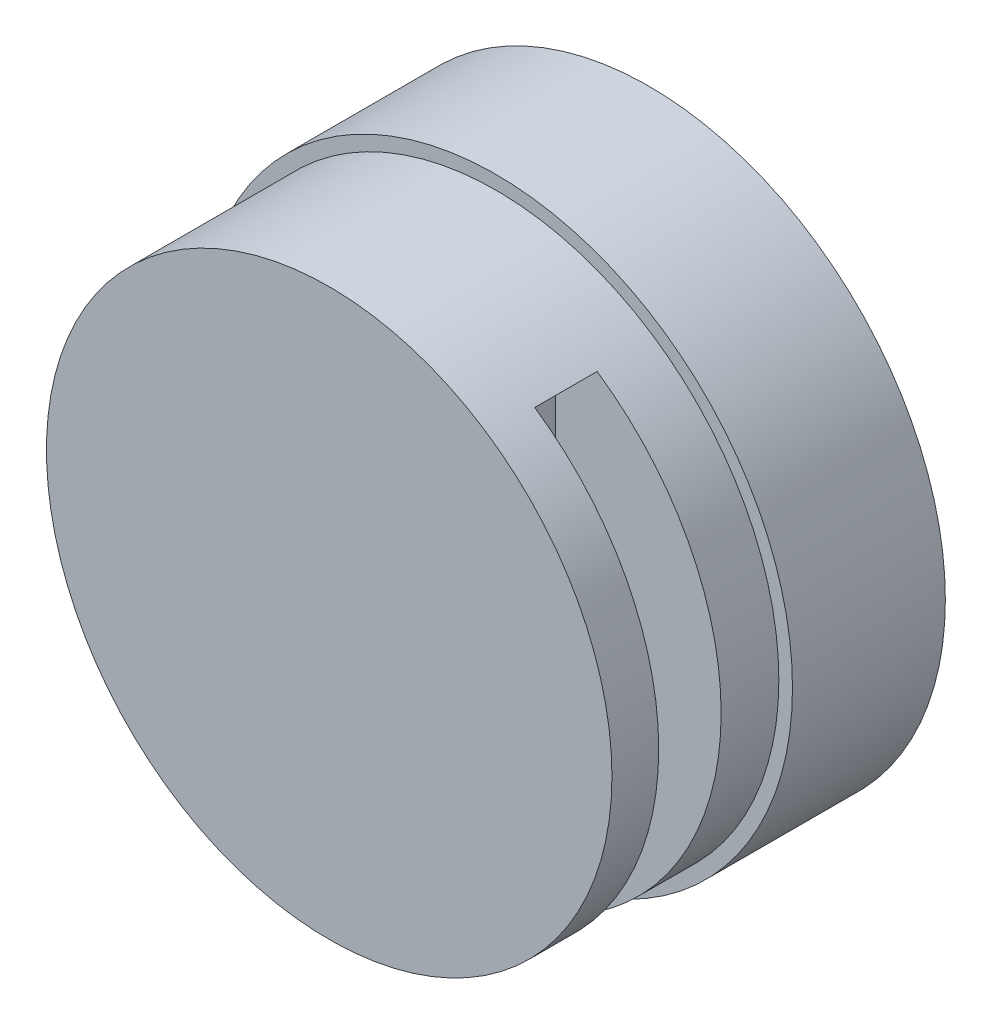
ISO-10303-21;
HEADER;
FILE_DESCRIPTION(('STEP AP214'),'2;1');
FILE_NAME('part.step','',(''),(''),'','','');
FILE_SCHEMA(('AUTOMOTIVE_DESIGN { 1 0 10303 214 1 1 1 1 }'));
ENDSEC;
DATA;
#1=APPLICATION_CONTEXT('core data for automotive mechanical design processes');
#2=APPLICATION_PROTOCOL_DEFINITION('international standard','automotive_design',2000,#1);
#3=PRODUCT_CONTEXT('',#1,'mechanical');
#4=PRODUCT('Part','Part','',(#3));
#5=PRODUCT_RELATED_PRODUCT_CATEGORY('part','',(#4));
#6=PRODUCT_DEFINITION_FORMATION('','',#4);
#7=PRODUCT_DEFINITION_CONTEXT('part definition',#1,'design');
#8=PRODUCT_DEFINITION('design','',#6,#7);
#9=PRODUCT_DEFINITION_SHAPE('','',#8);
#10=(LENGTH_UNIT() NAMED_UNIT(*) SI_UNIT(.MILLI.,.METRE.));
#11=(NAMED_UNIT(*) PLANE_ANGLE_UNIT() SI_UNIT($,.RADIAN.));
#12=(NAMED_UNIT(*) SI_UNIT($,.STERADIAN.) SOLID_ANGLE_UNIT());
#13=UNCERTAINTY_MEASURE_WITH_UNIT(LENGTH_MEASURE(1.E-05),#10,'distance_accuracy_value','');
#14=(GEOMETRIC_REPRESENTATION_CONTEXT(3) GLOBAL_UNCERTAINTY_ASSIGNED_CONTEXT((#13)) GLOBAL_UNIT_ASSIGNED_CONTEXT((#10,
#11,#12)) REPRESENTATION_CONTEXT('',''));
#15=CARTESIAN_POINT('',(0.,0.,0.));
#16=DIRECTION('',(0.,0.,1.));
#17=DIRECTION('',(1.,0.,0.));
#18=AXIS2_PLACEMENT_3D('',#15,#16,#17);
#19=CARTESIAN_POINT('',(0.,0.,41.));
#20=DIRECTION('',(0.,0.,-1.));
#21=DIRECTION('',(-1.,0.,0.));
#22=AXIS2_PLACEMENT_3D('',#19,#20,#21);
#23=CYLINDRICAL_SURFACE('',#22,36.25);
#24=CARTESIAN_POINT('',(0.,0.,19.6));
#25=DIRECTION('',(0.,0.,1.));
#26=DIRECTION('',(1.,0.,0.));
#27=AXIS2_PLACEMENT_3D('',#24,#25,#26);
#28=CIRCLE('',#27,36.25);
#29=CARTESIAN_POINT('',(36.25,0.,19.6));
#30=VERTEX_POINT('',#29);
#31=EDGE_CURVE('E11',#30,#30,#28,.T.);
#32=ORIENTED_EDGE('',*,*,#31,.T.);
#33=EDGE_LOOP('',(#32));
#34=FACE_BOUND('',#33,.T.);
#35=CARTESIAN_POINT('',(0.,0.,41.));
#36=DIRECTION('',(0.,0.,1.));
#37=DIRECTION('',(1.,0.,0.));
#38=AXIS2_PLACEMENT_3D('',#35,#36,#37);
#39=CIRCLE('',#38,36.25);
#40=CARTESIAN_POINT('',(36.25,0.,41.));
#41=VERTEX_POINT('',#40);
#42=EDGE_CURVE('E133',#41,#41,#39,.T.);
#43=ORIENTED_EDGE('',*,*,#42,.F.);
#44=EDGE_LOOP('',(#43));
#45=FACE_BOUND('',#44,.T.);
#46=DIRECTION('',(0.,0.,-1.));
#47=VECTOR('',#46,1.);
#48=CARTESIAN_POINT('',(20.3485257451246,30.,41.));
#49=LINE('',#48,#47);
#50=CARTESIAN_POINT('',(20.3485257451246,30.,35.));
#51=VERTEX_POINT('',#50);
#52=CARTESIAN_POINT('',(20.3485257451246,30.,27.));
#53=VERTEX_POINT('',#52);
#54=EDGE_CURVE('E94',#51,#53,#49,.T.);
#55=ORIENTED_EDGE('',*,*,#54,.T.);
#56=CARTESIAN_POINT('',(0.,0.,27.));
#57=DIRECTION('',(0.,0.,1.));
#58=DIRECTION('',(0.,-1.,0.));
#59=AXIS2_PLACEMENT_3D('',#56,#57,#58);
#60=CIRCLE('',#59,36.25);
#61=CARTESIAN_POINT('',(20.3485257451246,-30.,27.));
#62=VERTEX_POINT('',#61);
#63=EDGE_CURVE('E82',#53,#62,#60,.F.);
#64=ORIENTED_EDGE('',*,*,#63,.T.);
#65=DIRECTION('',(0.,0.,-1.));
#66=VECTOR('',#65,1.);
#67=CARTESIAN_POINT('',(20.3485257451246,-30.,41.));
#68=LINE('',#67,#66);
#69=CARTESIAN_POINT('',(20.3485257451246,-30.,35.));
#70=VERTEX_POINT('',#69);
#71=EDGE_CURVE('E77',#62,#70,#68,.F.);
#72=ORIENTED_EDGE('',*,*,#71,.T.);
#73=CARTESIAN_POINT('',(0.,0.,35.));
#74=DIRECTION('',(0.,0.,-1.));
#75=DIRECTION('',(0.,1.,0.));
#76=AXIS2_PLACEMENT_3D('',#73,#74,#75);
#77=CIRCLE('',#76,36.25);
#78=EDGE_CURVE('E97',#70,#51,#77,.F.);
#79=ORIENTED_EDGE('',*,*,#78,.T.);
#80=EDGE_LOOP('',(#55,#64,#72,#79));
#81=FACE_BOUND('',#80,.T.);
#82=ADVANCED_FACE('F36',(#34,#45,#81),#23,.T.);
#83=CARTESIAN_POINT('',(0.,0.,19.6));
#84=DIRECTION('',(0.,0.,-1.));
#85=DIRECTION('',(-1.,0.,0.));
#86=AXIS2_PLACEMENT_3D('',#83,#84,#85);
#87=CYLINDRICAL_SURFACE('',#86,38.);
#88=CARTESIAN_POINT('',(0.,0.,19.6));
#89=DIRECTION('',(0.,0.,1.));
#90=DIRECTION('',(1.,0.,0.));
#91=AXIS2_PLACEMENT_3D('',#88,#89,#90);
#92=CIRCLE('',#91,38.);
#93=CARTESIAN_POINT('',(38.,0.,19.6));
#94=VERTEX_POINT('',#93);
#95=EDGE_CURVE('E45',#94,#94,#92,.T.);
#96=ORIENTED_EDGE('',*,*,#95,.F.);
#97=EDGE_LOOP('',(#96));
#98=FACE_BOUND('',#97,.T.);
#99=CARTESIAN_POINT('',(0.,0.,0.));
#100=DIRECTION('',(0.,0.,1.));
#101=DIRECTION('',(1.,0.,0.));
#102=AXIS2_PLACEMENT_3D('',#99,#100,#101);
#103=CIRCLE('',#102,38.);
#104=CARTESIAN_POINT('',(38.,0.,0.));
#105=VERTEX_POINT('',#104);
#106=EDGE_CURVE('E40',#105,#105,#103,.T.);
#107=ORIENTED_EDGE('',*,*,#106,.T.);
#108=EDGE_LOOP('',(#107));
#109=FACE_BOUND('',#108,.T.);
#110=ADVANCED_FACE('F38',(#98,#109),#87,.T.);
#111=CARTESIAN_POINT('',(0.,0.,19.6));
#112=DIRECTION('',(0.,0.,1.));
#113=DIRECTION('',(1.,0.,0.));
#114=AXIS2_PLACEMENT_3D('',#111,#112,#113);
#115=PLANE('',#114);
#116=ORIENTED_EDGE('',*,*,#31,.F.);
#117=EDGE_LOOP('',(#116));
#118=FACE_BOUND('',#117,.T.);
#119=ORIENTED_EDGE('',*,*,#95,.T.);
#120=EDGE_LOOP('',(#119));
#121=FACE_BOUND('',#120,.T.);
#122=ADVANCED_FACE('F147',(#118,#121),#115,.T.);
#123=CARTESIAN_POINT('',(0.,0.,0.));
#124=DIRECTION('',(0.,0.,1.));
#125=DIRECTION('',(1.,0.,0.));
#126=AXIS2_PLACEMENT_3D('',#123,#124,#125);
#127=PLANE('',#126);
#128=CARTESIAN_POINT('',(20.8596500450032,20.8596500450031,0.));
#129=DIRECTION('',(0.,0.,-1.));
#130=DIRECTION('',(-1.,0.,0.));
#131=AXIS2_PLACEMENT_3D('',#128,#129,#130);
#132=CIRCLE('',#131,1.5);
#133=CARTESIAN_POINT('',(19.3596500450031,20.8596500450031,0.));
#134=VERTEX_POINT('',#133);
#135=EDGE_CURVE('E127',#134,#134,#132,.T.);
#136=ORIENTED_EDGE('',*,*,#135,.F.);
#137=EDGE_LOOP('',(#136));
#138=FACE_BOUND('',#137,.T.);
#139=CARTESIAN_POINT('',(20.8596500450031,-20.8596500450032,0.));
#140=DIRECTION('',(0.,0.,-1.));
#141=DIRECTION('',(-1.,0.,0.));
#142=AXIS2_PLACEMENT_3D('',#139,#140,#141);
#143=CIRCLE('',#142,1.5);
#144=CARTESIAN_POINT('',(19.3596500450031,-20.8596500450032,0.));
#145=VERTEX_POINT('',#144);
#146=EDGE_CURVE('E121',#145,#145,#143,.T.);
#147=ORIENTED_EDGE('',*,*,#146,.F.);
#148=EDGE_LOOP('',(#147));
#149=FACE_BOUND('',#148,.T.);
#150=CARTESIAN_POINT('',(-20.8596500450031,-20.8596500450031,0.));
#151=DIRECTION('',(0.,0.,-1.));
#152=DIRECTION('',(-1.,0.,0.));
#153=AXIS2_PLACEMENT_3D('',#150,#151,#152);
#154=CIRCLE('',#153,1.5);
#155=CARTESIAN_POINT('',(-22.3596500450032,-20.8596500450031,0.));
#156=VERTEX_POINT('',#155);
#157=EDGE_CURVE('E115',#156,#156,#154,.T.);
#158=ORIENTED_EDGE('',*,*,#157,.F.);
#159=EDGE_LOOP('',(#158));
#160=FACE_BOUND('',#159,.T.);
#161=CARTESIAN_POINT('',(-20.8596500450031,20.8596500450031,0.));
#162=DIRECTION('',(0.,0.,-1.));
#163=DIRECTION('',(-1.,0.,0.));
#164=AXIS2_PLACEMENT_3D('',#161,#162,#163);
#165=CIRCLE('',#164,1.5);
#166=CARTESIAN_POINT('',(-22.3596500450032,20.8596500450031,0.));
#167=VERTEX_POINT('',#166);
#168=EDGE_CURVE('E114',#167,#167,#165,.T.);
#169=ORIENTED_EDGE('',*,*,#168,.F.);
#170=EDGE_LOOP('',(#169));
#171=FACE_BOUND('',#170,.T.);
#172=ORIENTED_EDGE('',*,*,#106,.F.);
#173=EDGE_LOOP('',(#172));
#174=FACE_BOUND('',#173,.T.);
#175=ADVANCED_FACE('F144',(#138,#149,#160,#171,#174),#127,.F.);
#176=CARTESIAN_POINT('',(0.,0.,41.));
#177=DIRECTION('',(0.,0.,1.));
#178=DIRECTION('',(1.,0.,0.));
#179=AXIS2_PLACEMENT_3D('',#176,#177,#178);
#180=PLANE('',#179);
#181=ORIENTED_EDGE('',*,*,#42,.T.);
#182=EDGE_LOOP('',(#181));
#183=FACE_BOUND('',#182,.T.);
#184=ADVANCED_FACE('F146',(#183),#180,.T.);
#185=CARTESIAN_POINT('',(-20.8596500450031,20.8596500450031,4.));
#186=DIRECTION('',(0.,0.,-1.));
#187=DIRECTION('',(-1.,0.,0.));
#188=AXIS2_PLACEMENT_3D('',#185,#186,#187);
#189=CYLINDRICAL_SURFACE('',#188,1.5);
#190=CARTESIAN_POINT('',(-20.8596500450031,20.8596500450031,4.));
#191=DIRECTION('',(0.,0.,-1.));
#192=DIRECTION('',(-1.,0.,0.));
#193=AXIS2_PLACEMENT_3D('',#190,#191,#192);
#194=CIRCLE('',#193,1.5);
#195=CARTESIAN_POINT('',(-22.3596500450032,20.8596500450031,4.));
#196=VERTEX_POINT('',#195);
#197=EDGE_CURVE('E130',#196,#196,#194,.T.);
#198=ORIENTED_EDGE('',*,*,#197,.F.);
#199=EDGE_LOOP('',(#198));
#200=FACE_BOUND('',#199,.T.);
#201=ORIENTED_EDGE('',*,*,#168,.T.);
#202=EDGE_LOOP('',(#201));
#203=FACE_BOUND('',#202,.T.);
#204=ADVANCED_FACE('F153',(#200,#203),#189,.F.);
#205=CARTESIAN_POINT('',(-20.8596500450031,20.8596500450031,4.));
#206=DIRECTION('',(0.,0.,-1.));
#207=DIRECTION('',(-1.,0.,0.));
#208=AXIS2_PLACEMENT_3D('',#205,#206,#207);
#209=PLANE('',#208);
#210=ORIENTED_EDGE('',*,*,#197,.T.);
#211=EDGE_LOOP('',(#210));
#212=FACE_BOUND('',#211,.T.);
#213=ADVANCED_FACE('F171',(#212),#209,.T.);
#214=CARTESIAN_POINT('',(-20.8596500450031,-20.8596500450031,4.));
#215=DIRECTION('',(0.,0.,-1.));
#216=DIRECTION('',(-1.,0.,0.));
#217=AXIS2_PLACEMENT_3D('',#214,#215,#216);
#218=CYLINDRICAL_SURFACE('',#217,1.5);
#219=CARTESIAN_POINT('',(-20.8596500450031,-20.8596500450031,4.));
#220=DIRECTION('',(0.,0.,-1.));
#221=DIRECTION('',(-1.,0.,0.));
#222=AXIS2_PLACEMENT_3D('',#219,#220,#221);
#223=CIRCLE('',#222,1.5);
#224=CARTESIAN_POINT('',(-22.3596500450032,-20.8596500450031,4.));
#225=VERTEX_POINT('',#224);
#226=EDGE_CURVE('E111',#225,#225,#223,.T.);
#227=ORIENTED_EDGE('',*,*,#226,.F.);
#228=EDGE_LOOP('',(#227));
#229=FACE_BOUND('',#228,.T.);
#230=ORIENTED_EDGE('',*,*,#157,.T.);
#231=EDGE_LOOP('',(#230));
#232=FACE_BOUND('',#231,.T.);
#233=ADVANCED_FACE('F175',(#229,#232),#218,.F.);
#234=CARTESIAN_POINT('',(-20.8596500450031,-20.8596500450031,4.));
#235=DIRECTION('',(0.,0.,-1.));
#236=DIRECTION('',(-1.,0.,0.));
#237=AXIS2_PLACEMENT_3D('',#234,#235,#236);
#238=PLANE('',#237);
#239=ORIENTED_EDGE('',*,*,#226,.T.);
#240=EDGE_LOOP('',(#239));
#241=FACE_BOUND('',#240,.T.);
#242=ADVANCED_FACE('F190',(#241),#238,.T.);
#243=CARTESIAN_POINT('',(20.8596500450031,-20.8596500450032,4.));
#244=DIRECTION('',(0.,0.,-1.));
#245=DIRECTION('',(-1.,0.,0.));
#246=AXIS2_PLACEMENT_3D('',#243,#244,#245);
#247=CYLINDRICAL_SURFACE('',#246,1.5);
#248=CARTESIAN_POINT('',(20.8596500450031,-20.8596500450032,4.));
#249=DIRECTION('',(0.,0.,-1.));
#250=DIRECTION('',(-1.,0.,0.));
#251=AXIS2_PLACEMENT_3D('',#248,#249,#250);
#252=CIRCLE('',#251,1.5);
#253=CARTESIAN_POINT('',(19.3596500450031,-20.8596500450032,4.));
#254=VERTEX_POINT('',#253);
#255=EDGE_CURVE('E118',#254,#254,#252,.T.);
#256=ORIENTED_EDGE('',*,*,#255,.F.);
#257=EDGE_LOOP('',(#256));
#258=FACE_BOUND('',#257,.T.);
#259=ORIENTED_EDGE('',*,*,#146,.T.);
#260=EDGE_LOOP('',(#259));
#261=FACE_BOUND('',#260,.T.);
#262=ADVANCED_FACE('F187',(#258,#261),#247,.F.);
#263=CARTESIAN_POINT('',(20.8596500450031,-20.8596500450032,4.));
#264=DIRECTION('',(0.,0.,-1.));
#265=DIRECTION('',(-1.,0.,0.));
#266=AXIS2_PLACEMENT_3D('',#263,#264,#265);
#267=PLANE('',#266);
#268=ORIENTED_EDGE('',*,*,#255,.T.);
#269=EDGE_LOOP('',(#268));
#270=FACE_BOUND('',#269,.T.);
#271=ADVANCED_FACE('F181',(#270),#267,.T.);
#272=CARTESIAN_POINT('',(20.8596500450032,20.8596500450031,4.));
#273=DIRECTION('',(0.,0.,-1.));
#274=DIRECTION('',(-1.,0.,0.));
#275=AXIS2_PLACEMENT_3D('',#272,#273,#274);
#276=CYLINDRICAL_SURFACE('',#275,1.5);
#277=CARTESIAN_POINT('',(20.8596500450032,20.8596500450031,4.));
#278=DIRECTION('',(0.,0.,-1.));
#279=DIRECTION('',(-1.,0.,0.));
#280=AXIS2_PLACEMENT_3D('',#277,#278,#279);
#281=CIRCLE('',#280,1.5);
#282=CARTESIAN_POINT('',(19.3596500450031,20.8596500450031,4.));
#283=VERTEX_POINT('',#282);
#284=EDGE_CURVE('E124',#283,#283,#281,.T.);
#285=ORIENTED_EDGE('',*,*,#284,.F.);
#286=EDGE_LOOP('',(#285));
#287=FACE_BOUND('',#286,.T.);
#288=ORIENTED_EDGE('',*,*,#135,.T.);
#289=EDGE_LOOP('',(#288));
#290=FACE_BOUND('',#289,.T.);
#291=ADVANCED_FACE('F177',(#287,#290),#276,.F.);
#292=CARTESIAN_POINT('',(20.8596500450032,20.8596500450031,4.));
#293=DIRECTION('',(0.,0.,-1.));
#294=DIRECTION('',(-1.,0.,0.));
#295=AXIS2_PLACEMENT_3D('',#292,#293,#294);
#296=PLANE('',#295);
#297=ORIENTED_EDGE('',*,*,#284,.T.);
#298=EDGE_LOOP('',(#297));
#299=FACE_BOUND('',#298,.T.);
#300=ADVANCED_FACE('F180',(#299),#296,.T.);
#301=CARTESIAN_POINT('',(15.,0.,0.));
#302=DIRECTION('',(1.,0.,0.));
#303=DIRECTION('',(0.,0.,-1.));
#304=AXIS2_PLACEMENT_3D('',#301,#302,#303);
#305=PLANE('',#304);
#306=DIRECTION('',(0.,-1.,0.));
#307=VECTOR('',#306,1.);
#308=CARTESIAN_POINT('',(15.,30.,35.));
#309=LINE('',#308,#307);
#310=CARTESIAN_POINT('',(15.,30.,35.));
#311=VERTEX_POINT('',#310);
#312=CARTESIAN_POINT('',(15.,-30.,35.));
#313=VERTEX_POINT('',#312);
#314=EDGE_CURVE('E101',#311,#313,#309,.T.);
#315=ORIENTED_EDGE('',*,*,#314,.T.);
#316=DIRECTION('',(0.,0.,-1.));
#317=VECTOR('',#316,1.);
#318=CARTESIAN_POINT('',(15.,-30.,35.));
#319=LINE('',#318,#317);
#320=CARTESIAN_POINT('',(15.,-30.,27.));
#321=VERTEX_POINT('',#320);
#322=EDGE_CURVE('E104',#313,#321,#319,.T.);
#323=ORIENTED_EDGE('',*,*,#322,.T.);
#324=DIRECTION('',(0.,1.,0.));
#325=VECTOR('',#324,1.);
#326=CARTESIAN_POINT('',(15.,30.,27.));
#327=LINE('',#326,#325);
#328=CARTESIAN_POINT('',(15.,30.,27.));
#329=VERTEX_POINT('',#328);
#330=EDGE_CURVE('E106',#321,#329,#327,.T.);
#331=ORIENTED_EDGE('',*,*,#330,.T.);
#332=DIRECTION('',(0.,0.,1.));
#333=VECTOR('',#332,1.);
#334=CARTESIAN_POINT('',(15.,30.,35.));
#335=LINE('',#334,#333);
#336=EDGE_CURVE('E91',#329,#311,#335,.T.);
#337=ORIENTED_EDGE('',*,*,#336,.T.);
#338=EDGE_LOOP('',(#315,#323,#331,#337));
#339=FACE_BOUND('',#338,.T.);
#340=ADVANCED_FACE('F185',(#339),#305,.T.);
#341=CARTESIAN_POINT('',(38.001,30.,35.));
#342=DIRECTION('',(0.,-1.,0.));
#343=DIRECTION('',(0.,0.,-1.));
#344=AXIS2_PLACEMENT_3D('',#341,#342,#343);
#345=PLANE('',#344);
#346=DIRECTION('',(-1.,0.,0.));
#347=VECTOR('',#346,1.);
#348=CARTESIAN_POINT('',(38.001,30.,35.));
#349=LINE('',#348,#347);
#350=EDGE_CURVE('E53',#51,#311,#349,.T.);
#351=ORIENTED_EDGE('',*,*,#350,.T.);
#352=ORIENTED_EDGE('',*,*,#336,.F.);
#353=DIRECTION('',(-1.,0.,0.));
#354=VECTOR('',#353,1.);
#355=CARTESIAN_POINT('',(38.001,30.,27.));
#356=LINE('',#355,#354);
#357=EDGE_CURVE('E86',#53,#329,#356,.T.);
#358=ORIENTED_EDGE('',*,*,#357,.F.);
#359=ORIENTED_EDGE('',*,*,#54,.F.);
#360=EDGE_LOOP('',(#351,#352,#358,#359));
#361=FACE_BOUND('',#360,.T.);
#362=ADVANCED_FACE('F93',(#361),#345,.T.);
#363=CARTESIAN_POINT('',(38.001,30.,27.));
#364=DIRECTION('',(0.,0.,1.));
#365=DIRECTION('',(0.,-1.,0.));
#366=AXIS2_PLACEMENT_3D('',#363,#364,#365);
#367=PLANE('',#366);
#368=ORIENTED_EDGE('',*,*,#357,.T.);
#369=ORIENTED_EDGE('',*,*,#330,.F.);
#370=DIRECTION('',(-1.,0.,0.));
#371=VECTOR('',#370,1.);
#372=CARTESIAN_POINT('',(38.001,-30.,27.));
#373=LINE('',#372,#371);
#374=EDGE_CURVE('E88',#62,#321,#373,.T.);
#375=ORIENTED_EDGE('',*,*,#374,.F.);
#376=ORIENTED_EDGE('',*,*,#63,.F.);
#377=EDGE_LOOP('',(#368,#369,#375,#376));
#378=FACE_BOUND('',#377,.T.);
#379=ADVANCED_FACE('F84',(#378),#367,.T.);
#380=CARTESIAN_POINT('',(38.001,-30.,35.));
#381=DIRECTION('',(0.,1.,0.));
#382=DIRECTION('',(0.,0.,1.));
#383=AXIS2_PLACEMENT_3D('',#380,#381,#382);
#384=PLANE('',#383);
#385=ORIENTED_EDGE('',*,*,#374,.T.);
#386=ORIENTED_EDGE('',*,*,#322,.F.);
#387=DIRECTION('',(-1.,0.,0.));
#388=VECTOR('',#387,1.);
#389=CARTESIAN_POINT('',(38.001,-30.,35.));
#390=LINE('',#389,#388);
#391=EDGE_CURVE('E105',#70,#313,#390,.T.);
#392=ORIENTED_EDGE('',*,*,#391,.F.);
#393=ORIENTED_EDGE('',*,*,#71,.F.);
#394=EDGE_LOOP('',(#385,#386,#392,#393));
#395=FACE_BOUND('',#394,.T.);
#396=ADVANCED_FACE('F205',(#395),#384,.T.);
#397=CARTESIAN_POINT('',(38.001,30.,35.));
#398=DIRECTION('',(0.,0.,-1.));
#399=DIRECTION('',(0.,1.,0.));
#400=AXIS2_PLACEMENT_3D('',#397,#398,#399);
#401=PLANE('',#400);
#402=ORIENTED_EDGE('',*,*,#391,.T.);
#403=ORIENTED_EDGE('',*,*,#314,.F.);
#404=ORIENTED_EDGE('',*,*,#350,.F.);
#405=ORIENTED_EDGE('',*,*,#78,.F.);
#406=EDGE_LOOP('',(#402,#403,#404,#405));
#407=FACE_BOUND('',#406,.T.);
#408=ADVANCED_FACE('F208',(#407),#401,.T.);
#409=CLOSED_SHELL('',(#82,#110,#122,#175,#184,#204,#213,#233,#242,#262,#271,#291,#300,#340,#362,
#379,#396,#408));
#410=MANIFOLD_SOLID_BREP('B2',#409);
#411=ADVANCED_BREP_SHAPE_REPRESENTATION('',(#18,#410),#14);
#412=SHAPE_DEFINITION_REPRESENTATION(#9,#411);
ENDSEC;
END-ISO-10303-21;
